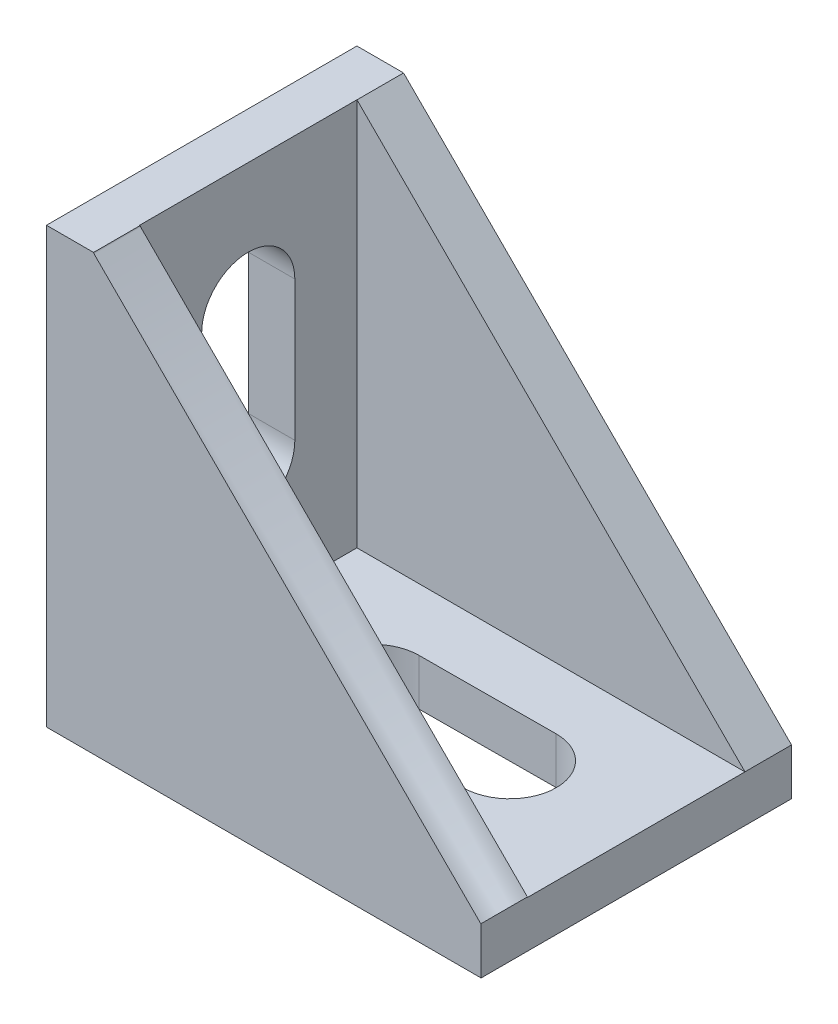
ISO-10303-21;
HEADER;
FILE_DESCRIPTION(('STEP AP214'),'2;1');
FILE_NAME('part.step','',(''),(''),'','','');
FILE_SCHEMA(('AUTOMOTIVE_DESIGN { 1 0 10303 214 1 1 1 1 }'));
ENDSEC;
DATA;
#1=APPLICATION_CONTEXT('core data for automotive mechanical design processes');
#2=APPLICATION_PROTOCOL_DEFINITION('international standard','automotive_design',2000,#1);
#3=PRODUCT_CONTEXT('',#1,'mechanical');
#4=PRODUCT('Part','Part','',(#3));
#5=PRODUCT_RELATED_PRODUCT_CATEGORY('part','',(#4));
#6=PRODUCT_DEFINITION_FORMATION('','',#4);
#7=PRODUCT_DEFINITION_CONTEXT('part definition',#1,'design');
#8=PRODUCT_DEFINITION('design','',#6,#7);
#9=PRODUCT_DEFINITION_SHAPE('','',#8);
#10=(LENGTH_UNIT() NAMED_UNIT(*) SI_UNIT(.MILLI.,.METRE.));
#11=(NAMED_UNIT(*) PLANE_ANGLE_UNIT() SI_UNIT($,.RADIAN.));
#12=(NAMED_UNIT(*) SI_UNIT($,.STERADIAN.) SOLID_ANGLE_UNIT());
#13=UNCERTAINTY_MEASURE_WITH_UNIT(LENGTH_MEASURE(1.E-05),#10,'distance_accuracy_value','');
#14=(GEOMETRIC_REPRESENTATION_CONTEXT(3) GLOBAL_UNCERTAINTY_ASSIGNED_CONTEXT((#13)) GLOBAL_UNIT_ASSIGNED_CONTEXT((#10,
#11,#12)) REPRESENTATION_CONTEXT('',''));
#15=CARTESIAN_POINT('',(0.,0.,0.));
#16=DIRECTION('',(0.,0.,1.));
#17=DIRECTION('',(1.,0.,0.));
#18=AXIS2_PLACEMENT_3D('',#15,#16,#17);
#19=CARTESIAN_POINT('',(0.,3.,0.));
#20=DIRECTION('',(0.,1.,0.));
#21=DIRECTION('',(0.,0.,1.));
#22=AXIS2_PLACEMENT_3D('',#19,#20,#21);
#23=PLANE('',#22);
#24=CARTESIAN_POINT('',(6.62955116916919,3.,-2.27958773683667));
#25=DIRECTION('',(0.,1.,0.));
#26=DIRECTION('',(0.,0.,1.));
#27=AXIS2_PLACEMENT_3D('',#24,#25,#26);
#28=CIRCLE('',#27,3.);
#29=CARTESIAN_POINT('',(6.64380261373427,3.,0.720378412360314));
#30=VERTEX_POINT('',#29);
#31=CARTESIAN_POINT('',(6.6152997246041,3.,-5.27955388603366));
#32=VERTEX_POINT('',#31);
#33=EDGE_CURVE('E48',#30,#32,#28,.T.);
#34=ORIENTED_EDGE('',*,*,#33,.F.);
#35=DIRECTION('',(0.999988716398996,0.,-0.00475048152169508));
#36=VECTOR('',#35,1.);
#37=CARTESIAN_POINT('',(6.64380261373427,3.,0.720378412360314));
#38=LINE('',#37,#36);
#39=CARTESIAN_POINT('',(-2.16057373026007,3.,0.762203911434752));
#40=VERTEX_POINT('',#39);
#41=EDGE_CURVE('E176',#40,#30,#38,.T.);
#42=ORIENTED_EDGE('',*,*,#41,.F.);
#43=CARTESIAN_POINT('',(-2.17482517482515,3.,-2.23776223776224));
#44=DIRECTION('',(0.,1.,0.));
#45=DIRECTION('',(0.,0.,1.));
#46=AXIS2_PLACEMENT_3D('',#43,#44,#45);
#47=CIRCLE('',#46,3.);
#48=CARTESIAN_POINT('',(-2.18907661939024,3.,-5.23772838695923));
#49=VERTEX_POINT('',#48);
#50=EDGE_CURVE('E161',#49,#40,#47,.T.);
#51=ORIENTED_EDGE('',*,*,#50,.F.);
#52=DIRECTION('',(-0.999988716398996,0.,0.00475048152169508));
#53=VECTOR('',#52,1.);
#54=CARTESIAN_POINT('',(6.6152997246041,3.,-5.27955388603366));
#55=LINE('',#54,#53);
#56=EDGE_CURVE('E170',#32,#49,#55,.T.);
#57=ORIENTED_EDGE('',*,*,#56,.F.);
#58=EDGE_LOOP('',(#34,#42,#51,#57));
#59=FACE_BOUND('',#58,.T.);
#60=DIRECTION('',(0.,0.,-1.));
#61=VECTOR('',#60,1.);
#62=CARTESIAN_POINT('',(14.8251748251748,3.,-12.2377622377622));
#63=LINE('',#62,#61);
#64=CARTESIAN_POINT('',(14.8251748251748,3.,4.76223776223776));
#65=VERTEX_POINT('',#64);
#66=CARTESIAN_POINT('',(14.8251748251748,3.,-9.23776223776224));
#67=VERTEX_POINT('',#66);
#68=EDGE_CURVE('E288',#65,#67,#63,.T.);
#69=ORIENTED_EDGE('',*,*,#68,.T.);
#70=DIRECTION('',(1.,0.,0.));
#71=VECTOR('',#70,1.);
#72=CARTESIAN_POINT('',(14.8251748251748,3.,-9.23776223776224));
#73=LINE('',#72,#71);
#74=CARTESIAN_POINT('',(-10.1748251748252,3.,-9.23776223776224));
#75=VERTEX_POINT('',#74);
#76=EDGE_CURVE('E254',#75,#67,#73,.T.);
#77=ORIENTED_EDGE('',*,*,#76,.F.);
#78=DIRECTION('',(0.,0.,-1.));
#79=VECTOR('',#78,1.);
#80=CARTESIAN_POINT('',(-10.1748251748252,3.,-12.2377622377622));
#81=LINE('',#80,#79);
#82=CARTESIAN_POINT('',(-10.1748251748252,3.,4.76223776223776));
#83=VERTEX_POINT('',#82);
#84=EDGE_CURVE('E273',#83,#75,#81,.T.);
#85=ORIENTED_EDGE('',*,*,#84,.F.);
#86=DIRECTION('',(-1.,0.,0.));
#87=VECTOR('',#86,1.);
#88=CARTESIAN_POINT('',(14.8251748251748,3.,4.76223776223776));
#89=LINE('',#88,#87);
#90=EDGE_CURVE('E264',#65,#83,#89,.T.);
#91=ORIENTED_EDGE('',*,*,#90,.F.);
#92=EDGE_LOOP('',(#69,#77,#85,#91));
#93=FACE_BOUND('',#92,.T.);
#94=ADVANCED_FACE('F33',(#59,#93),#23,.T.);
#95=CARTESIAN_POINT('',(-10.1748251748252,28.,-12.2377622377622));
#96=DIRECTION('',(-1.,0.,0.));
#97=DIRECTION('',(0.,0.,1.));
#98=AXIS2_PLACEMENT_3D('',#95,#96,#97);
#99=PLANE('',#98);
#100=DIRECTION('',(0.,1.,0.));
#101=VECTOR('',#100,1.);
#102=CARTESIAN_POINT('',(-10.1748251748252,11.,-5.23776223776224));
#103=LINE('',#102,#101);
#104=CARTESIAN_POINT('',(-10.1748251748252,11.,-5.23776223776224));
#105=VERTEX_POINT('',#104);
#106=CARTESIAN_POINT('',(-10.1748251748252,20.,-5.23776223776223));
#107=VERTEX_POINT('',#106);
#108=EDGE_CURVE('E187',#105,#107,#103,.T.);
#109=ORIENTED_EDGE('',*,*,#108,.F.);
#110=CARTESIAN_POINT('',(-10.1748251748252,11.,-2.23776223776224));
#111=DIRECTION('',(1.,0.,0.));
#112=DIRECTION('',(0.,0.,-1.));
#113=AXIS2_PLACEMENT_3D('',#110,#111,#112);
#114=CIRCLE('',#113,3.);
#115=CARTESIAN_POINT('',(-10.1748251748252,11.,0.762237762237761));
#116=VERTEX_POINT('',#115);
#117=EDGE_CURVE('E183',#116,#105,#114,.T.);
#118=ORIENTED_EDGE('',*,*,#117,.F.);
#119=DIRECTION('',(0.,-1.,0.));
#120=VECTOR('',#119,1.);
#121=CARTESIAN_POINT('',(-10.1748251748252,11.,0.762237762237761));
#122=LINE('',#121,#120);
#123=CARTESIAN_POINT('',(-10.1748251748252,20.,0.762237762237761));
#124=VERTEX_POINT('',#123);
#125=EDGE_CURVE('E193',#124,#116,#122,.T.);
#126=ORIENTED_EDGE('',*,*,#125,.F.);
#127=CARTESIAN_POINT('',(-10.1748251748252,20.,-2.23776223776224));
#128=DIRECTION('',(1.,0.,0.));
#129=DIRECTION('',(0.,0.,-1.));
#130=AXIS2_PLACEMENT_3D('',#127,#128,#129);
#131=CIRCLE('',#130,3.);
#132=EDGE_CURVE('E190',#107,#124,#131,.T.);
#133=ORIENTED_EDGE('',*,*,#132,.F.);
#134=EDGE_LOOP('',(#109,#118,#126,#133));
#135=FACE_BOUND('',#134,.T.);
#136=DIRECTION('',(0.,-1.,0.));
#137=VECTOR('',#136,1.);
#138=CARTESIAN_POINT('',(-10.1748251748252,28.,-9.23776223776224));
#139=LINE('',#138,#137);
#140=CARTESIAN_POINT('',(-10.1748251748252,28.,-9.23776223776224));
#141=VERTEX_POINT('',#140);
#142=EDGE_CURVE('E262',#141,#75,#139,.T.);
#143=ORIENTED_EDGE('',*,*,#142,.F.);
#144=DIRECTION('',(0.,0.,-1.));
#145=VECTOR('',#144,1.);
#146=CARTESIAN_POINT('',(-10.1748251748252,28.,-12.2377622377622));
#147=LINE('',#146,#145);
#148=CARTESIAN_POINT('',(-10.1748251748252,28.,4.76223776223777));
#149=VERTEX_POINT('',#148);
#150=EDGE_CURVE('E280',#149,#141,#147,.T.);
#151=ORIENTED_EDGE('',*,*,#150,.F.);
#152=DIRECTION('',(0.,-1.,0.));
#153=VECTOR('',#152,1.);
#154=CARTESIAN_POINT('',(-10.1748251748252,28.,4.76223776223776));
#155=LINE('',#154,#153);
#156=EDGE_CURVE('E267',#149,#83,#155,.T.);
#157=ORIENTED_EDGE('',*,*,#156,.T.);
#158=ORIENTED_EDGE('',*,*,#84,.T.);
#159=EDGE_LOOP('',(#143,#151,#157,#158));
#160=FACE_BOUND('',#159,.T.);
#161=ADVANCED_FACE('F354',(#135,#160),#99,.F.);
#162=CARTESIAN_POINT('',(-13.1748251748252,3.,-12.2377622377622));
#163=DIRECTION('',(1.,0.,0.));
#164=DIRECTION('',(0.,0.,-1.));
#165=AXIS2_PLACEMENT_3D('',#162,#163,#164);
#166=PLANE('',#165);
#167=DIRECTION('',(0.,-1.,0.));
#168=VECTOR('',#167,1.);
#169=CARTESIAN_POINT('',(-13.1748251748252,3.,0.762237762237761));
#170=LINE('',#169,#168);
#171=CARTESIAN_POINT('',(-13.1748251748252,20.,0.762237762237762));
#172=VERTEX_POINT('',#171);
#173=CARTESIAN_POINT('',(-13.1748251748252,11.,0.762237762237762));
#174=VERTEX_POINT('',#173);
#175=EDGE_CURVE('E325',#172,#174,#170,.T.);
#176=ORIENTED_EDGE('',*,*,#175,.T.);
#177=CARTESIAN_POINT('',(-13.1748251748252,11.,-2.23776223776224));
#178=DIRECTION('',(1.,0.,0.));
#179=DIRECTION('',(0.,0.,-1.));
#180=AXIS2_PLACEMENT_3D('',#177,#178,#179);
#181=CIRCLE('',#180,3.);
#182=CARTESIAN_POINT('',(-13.1748251748252,11.,-5.23776223776224));
#183=VERTEX_POINT('',#182);
#184=EDGE_CURVE('E328',#174,#183,#181,.T.);
#185=ORIENTED_EDGE('',*,*,#184,.T.);
#186=DIRECTION('',(0.,1.,0.));
#187=VECTOR('',#186,1.);
#188=CARTESIAN_POINT('',(-13.1748251748252,3.,-5.23776223776224));
#189=LINE('',#188,#187);
#190=CARTESIAN_POINT('',(-13.1748251748252,20.,-5.23776223776224));
#191=VERTEX_POINT('',#190);
#192=EDGE_CURVE('E316',#183,#191,#189,.T.);
#193=ORIENTED_EDGE('',*,*,#192,.T.);
#194=CARTESIAN_POINT('',(-13.1748251748252,20.,-2.23776223776224));
#195=DIRECTION('',(1.,0.,0.));
#196=DIRECTION('',(0.,0.,-1.));
#197=AXIS2_PLACEMENT_3D('',#194,#195,#196);
#198=CIRCLE('',#197,3.);
#199=EDGE_CURVE('E322',#191,#172,#198,.T.);
#200=ORIENTED_EDGE('',*,*,#199,.T.);
#201=EDGE_LOOP('',(#176,#185,#193,#200));
#202=FACE_BOUND('',#201,.T.);
#203=DIRECTION('',(0.,0.,1.));
#204=VECTOR('',#203,1.);
#205=CARTESIAN_POINT('',(-13.1748251748252,0.,-12.2377622377622));
#206=LINE('',#205,#204);
#207=CARTESIAN_POINT('',(-13.1748251748252,0.,-12.2377622377622));
#208=VERTEX_POINT('',#207);
#209=CARTESIAN_POINT('',(-13.1748251748252,0.,7.76223776223776));
#210=VERTEX_POINT('',#209);
#211=EDGE_CURVE('E285',#208,#210,#206,.T.);
#212=ORIENTED_EDGE('',*,*,#211,.T.);
#213=DIRECTION('',(0.,-1.,0.));
#214=VECTOR('',#213,1.);
#215=CARTESIAN_POINT('',(-13.1748251748252,3.,7.76223776223776));
#216=LINE('',#215,#214);
#217=CARTESIAN_POINT('',(-13.1748251748252,28.,7.76223776223776));
#218=VERTEX_POINT('',#217);
#219=EDGE_CURVE('E308',#218,#210,#216,.T.);
#220=ORIENTED_EDGE('',*,*,#219,.F.);
#221=DIRECTION('',(0.,0.,1.));
#222=VECTOR('',#221,1.);
#223=CARTESIAN_POINT('',(-13.1748251748252,28.,-12.2377622377622));
#224=LINE('',#223,#222);
#225=CARTESIAN_POINT('',(-13.1748251748252,28.,-12.2377622377622));
#226=VERTEX_POINT('',#225);
#227=EDGE_CURVE('E274',#226,#218,#224,.T.);
#228=ORIENTED_EDGE('',*,*,#227,.F.);
#229=DIRECTION('',(0.,-1.,0.));
#230=VECTOR('',#229,1.);
#231=CARTESIAN_POINT('',(-13.1748251748252,3.,-12.2377622377622));
#232=LINE('',#231,#230);
#233=EDGE_CURVE('E291',#226,#208,#232,.T.);
#234=ORIENTED_EDGE('',*,*,#233,.T.);
#235=EDGE_LOOP('',(#212,#220,#228,#234));
#236=FACE_BOUND('',#235,.T.);
#237=ADVANCED_FACE('F35',(#202,#236),#166,.F.);
#238=CARTESIAN_POINT('',(-13.1748251748252,3.,7.76223776223776));
#239=DIRECTION('',(0.,0.,-1.));
#240=DIRECTION('',(-1.,0.,0.));
#241=AXIS2_PLACEMENT_3D('',#238,#239,#240);
#242=PLANE('',#241);
#243=DIRECTION('',(0.,-1.,0.));
#244=VECTOR('',#243,1.);
#245=CARTESIAN_POINT('',(14.8251748251748,3.,7.76223776223776));
#246=LINE('',#245,#244);
#247=CARTESIAN_POINT('',(14.8251748251748,3.03348839103916,7.76223776223776));
#248=VERTEX_POINT('',#247);
#249=CARTESIAN_POINT('',(14.8251748251748,0.,7.76223776223776));
#250=VERTEX_POINT('',#249);
#251=EDGE_CURVE('E306',#248,#250,#246,.T.);
#252=ORIENTED_EDGE('',*,*,#251,.F.);
#253=CARTESIAN_POINT('',(35.0672525893617,33.9612128859628,7.76223776223775));
#254=CARTESIAN_POINT('',(35.0774542008554,33.9572279060878,7.76223776223775));
#255=CARTESIAN_POINT('',(35.0978574238427,33.9492579463377,7.76223776223775));
#256=CARTESIAN_POINT('',(35.1163083375369,33.8966490282362,7.76223776223775));
#257=CARTESIAN_POINT('',(35.105352773547,33.877680966017,7.76223776223775));
#258=CARTESIAN_POINT('',(35.0998749915521,33.8681969349074,7.76223776223775));
#259=CARTESIAN_POINT('',(30.3884412028001,25.7109930402229,7.76223776223775));
#260=CARTESIAN_POINT('',(25.677007414048,17.5537891455384,7.76223776223775));
#261=CARTESIAN_POINT('',(20.965573625296,9.39658525085391,7.76223776223775));
#262=CARTESIAN_POINT('',(20.8883973320785,9.26296504353752,7.76223776223775));
#263=CARTESIAN_POINT('',(20.7340447456437,8.99572462890472,7.76223776223775));
#264=CARTESIAN_POINT('',(20.4473893540673,8.6222145288925,7.76223776223775));
#265=CARTESIAN_POINT('',(20.2291668069369,8.40399198176201,7.76223776223775));
#266=CARTESIAN_POINT('',(20.1200555333716,8.29488070819676,7.76223776223775));
#267=CARTESIAN_POINT('',(18.3754565465604,6.55028172138555,7.76223776223775));
#268=CARTESIAN_POINT('',(16.6308575597492,4.80568273457433,7.76223776223775));
#269=CARTESIAN_POINT('',(14.886258572938,3.06108374776312,7.76223776223776));
#270=CARTESIAN_POINT('',(14.8766601879905,3.05148536281565,7.76223776223776));
#271=CARTESIAN_POINT('',(14.8574634180956,3.03228859292072,7.76223776223776));
#272=CARTESIAN_POINT('',(14.7928862322541,3.03228859292072,7.76223776223776));
#273=CARTESIAN_POINT('',(14.7736894623592,3.05148536281565,7.76223776223776));
#274=CARTESIAN_POINT('',(14.7640910774117,3.06108374776311,7.76223776223776));
#275=CARTESIAN_POINT('',(6.47713398757617,11.3480408375987,7.76223776223776));
#276=CARTESIAN_POINT('',(-1.80982310225939,19.6349979274342,7.76223776223776));
#277=CARTESIAN_POINT('',(-10.096780192095,27.9219550172698,7.76223776223776));
#278=CARTESIAN_POINT('',(-10.1104855499516,27.9356603751264,7.76223776223776));
#279=CARTESIAN_POINT('',(-10.1378962656648,27.9630710908397,7.76223776223776));
#280=CARTESIAN_POINT('',(-10.1482524753685,28.0449597632014,7.76223776223776));
#281=CARTESIAN_POINT('',(-10.1285287216183,28.0783314309726,7.76223776223776));
#282=CARTESIAN_POINT('',(-10.1186668447432,28.0950172648581,7.76223776223776));
#283=CARTESIAN_POINT('',(-8.17143615716044,31.3896404082466,7.76223776223776));
#284=CARTESIAN_POINT('',(-6.22420546957766,34.684263551635,7.76223776223776));
#285=CARTESIAN_POINT('',(-4.27697478199488,37.9788866950234,7.76223776223776));
#286=CARTESIAN_POINT('',(-4.25905817007432,38.0092007634392,7.76223776223776));
#287=CARTESIAN_POINT('',(-4.22322494623318,38.0698289002707,7.76223776223776));
#288=CARTESIAN_POINT('',(-4.11638728690729,38.1394755414262,7.76223776223776));
#289=CARTESIAN_POINT('',(-4.04645466319913,38.1477953399693,7.76223776223776));
#290=CARTESIAN_POINT('',(-4.01148835134505,38.1519552392409,7.76223776223776));
#291=CARTESIAN_POINT('',(3.09893559030034,38.9978736620586,7.76223776223776));
#292=CARTESIAN_POINT('',(10.2093595319457,39.8437920848762,7.76223776223776));
#293=CARTESIAN_POINT('',(17.3197834735911,40.6897105076939,7.76223776223775));
#294=CARTESIAN_POINT('',(17.3995441874561,40.6991995420791,7.76223776223775));
#295=CARTESIAN_POINT('',(17.559065615186,40.7181776108494,7.76223776223775));
#296=CARTESIAN_POINT('',(17.8141559939517,40.700662114853,7.76223776223775));
#297=CARTESIAN_POINT('',(17.9637913490545,40.6422111653098,7.76223776223775));
#298=CARTESIAN_POINT('',(18.0386090266059,40.6129856905382,7.76223776223775));
#299=CARTESIAN_POINT('',(23.7148235475245,38.3957280890131,7.76223776223775));
#300=CARTESIAN_POINT('',(29.3910380684431,36.1784704874879,7.76223776223775));
#301=CARTESIAN_POINT('',(35.0672525893617,33.9612128859628,7.76223776223775));
#302=B_SPLINE_CURVE_WITH_KNOTS('',3,(#253,#254,#255,#256,#257,#258,#259,#260,#261,#262,#263,
#264,#265,#266,#267,#268,#269,#270,#271,#272,#273,#274,#275,#276,#277,#278,#279,#280,#281,#282,
#283,#284,#285,#286,#287,#288,#289,#290,#291,#292,#293,#294,#295,#296,#297,#298,#299,#300,#301),
.UNSPECIFIED.,.T.,.F.,(4,1,1,3,3,1,1,3,3,1,1,3,3,1,1,3,3,1,1,3,3,1,1,3,4),(0.,
0.000263089380719506,0.000526178761439122,0.000789268142158628,0.227072132069683,
0.230778789838756,0.234485447607829,0.238192105376902,0.297458496255509,0.297784566394492,
0.298110636533475,0.298436706672459,0.579955864824744,0.580421454396905,0.580887043969066,
0.581352633541227,0.673283440852444,0.674129302931674,0.674975165010904,0.675821027090134,
0.847827671788225,0.849757145035282,0.851686618282339,0.853616091529395,1.),.UNSPECIFIED.);
#303=CARTESIAN_POINT('',(-10.1410099627485,28.,7.76223776223776));
#304=VERTEX_POINT('',#303);
#305=EDGE_CURVE('E383',#248,#304,#302,.T.);
#306=ORIENTED_EDGE('',*,*,#305,.T.);
#307=DIRECTION('',(1.,0.,0.));
#308=VECTOR('',#307,1.);
#309=CARTESIAN_POINT('',(-13.1748251748252,28.,7.76223776223776));
#310=LINE('',#309,#308);
#311=EDGE_CURVE('E277',#218,#304,#310,.T.);
#312=ORIENTED_EDGE('',*,*,#311,.F.);
#313=ORIENTED_EDGE('',*,*,#219,.T.);
#314=DIRECTION('',(1.,0.,0.));
#315=VECTOR('',#314,1.);
#316=CARTESIAN_POINT('',(-13.1748251748252,0.,7.76223776223776));
#317=LINE('',#316,#315);
#318=EDGE_CURVE('E295',#210,#250,#317,.T.);
#319=ORIENTED_EDGE('',*,*,#318,.T.);
#320=EDGE_LOOP('',(#252,#306,#312,#313,#319));
#321=FACE_BOUND('',#320,.T.);
#322=ADVANCED_FACE('F372',(#321),#242,.F.);
#323=CARTESIAN_POINT('',(14.8251748251748,3.,-12.2377622377622));
#324=DIRECTION('',(-1.,0.,0.));
#325=DIRECTION('',(0.,0.,1.));
#326=AXIS2_PLACEMENT_3D('',#323,#324,#325);
#327=PLANE('',#326);
#328=DIRECTION('',(0.,-1.,0.));
#329=VECTOR('',#328,1.);
#330=CARTESIAN_POINT('',(14.8251748251748,28.,4.76223776223776));
#331=LINE('',#330,#329);
#332=CARTESIAN_POINT('',(14.8251748251748,3.03348839103916,4.76223776223776));
#333=VERTEX_POINT('',#332);
#334=EDGE_CURVE('E271',#333,#65,#331,.T.);
#335=ORIENTED_EDGE('',*,*,#334,.F.);
#336=DIRECTION('',(0.,0.,-1.));
#337=VECTOR('',#336,1.);
#338=CARTESIAN_POINT('',(14.8251748251749,3.03348839103916,29.7622377622378));
#339=LINE('',#338,#337);
#340=EDGE_CURVE('E236',#333,#248,#339,.F.);
#341=ORIENTED_EDGE('',*,*,#340,.T.);
#342=ORIENTED_EDGE('',*,*,#251,.T.);
#343=DIRECTION('',(0.,0.,-1.));
#344=VECTOR('',#343,1.);
#345=CARTESIAN_POINT('',(14.8251748251748,0.,-12.2377622377622));
#346=LINE('',#345,#344);
#347=CARTESIAN_POINT('',(14.8251748251748,0.,-12.2377622377622));
#348=VERTEX_POINT('',#347);
#349=EDGE_CURVE('E298',#250,#348,#346,.T.);
#350=ORIENTED_EDGE('',*,*,#349,.T.);
#351=DIRECTION('',(0.,-1.,0.));
#352=VECTOR('',#351,1.);
#353=CARTESIAN_POINT('',(14.8251748251748,3.,-12.2377622377622));
#354=LINE('',#353,#352);
#355=CARTESIAN_POINT('',(14.8251748429918,3.00437816103314,-12.2377622377622));
#356=VERTEX_POINT('',#355);
#357=EDGE_CURVE('E304',#356,#348,#354,.T.);
#358=ORIENTED_EDGE('',*,*,#357,.F.);
#359=DIRECTION('',(0.,0.,1.));
#360=VECTOR('',#359,1.);
#361=CARTESIAN_POINT('',(14.8251748251748,3.00437816223935,-34.2377622377622));
#362=LINE('',#361,#360);
#363=CARTESIAN_POINT('',(14.8251748429923,3.00437816103311,-9.23776223776224));
#364=VERTEX_POINT('',#363);
#365=EDGE_CURVE('E248',#356,#364,#362,.T.);
#366=ORIENTED_EDGE('',*,*,#365,.T.);
#367=DIRECTION('',(0.,-1.,0.));
#368=VECTOR('',#367,1.);
#369=CARTESIAN_POINT('',(14.8251748251748,28.,-9.23776223776224));
#370=LINE('',#369,#368);
#371=EDGE_CURVE('E258',#364,#67,#370,.T.);
#372=ORIENTED_EDGE('',*,*,#371,.T.);
#373=ORIENTED_EDGE('',*,*,#68,.F.);
#374=EDGE_LOOP('',(#335,#341,#342,#350,#358,#366,#372,#373));
#375=FACE_BOUND('',#374,.T.);
#376=ADVANCED_FACE('F369',(#375),#327,.F.);
#377=CARTESIAN_POINT('',(-13.1748251748252,3.,-12.2377622377622));
#378=DIRECTION('',(0.,0.,1.));
#379=DIRECTION('',(1.,0.,0.));
#380=AXIS2_PLACEMENT_3D('',#377,#378,#379);
#381=PLANE('',#380);
#382=DIRECTION('',(-1.,0.,0.));
#383=VECTOR('',#382,1.);
#384=CARTESIAN_POINT('',(-13.1748251748252,28.,-12.2377622377622));
#385=LINE('',#384,#383);
#386=CARTESIAN_POINT('',(-10.1703433962215,28.,-12.2377622377622));
#387=VERTEX_POINT('',#386);
#388=EDGE_CURVE('E283',#387,#226,#385,.T.);
#389=ORIENTED_EDGE('',*,*,#388,.F.);
#390=CARTESIAN_POINT('',(14.8163682419722,3.00880658320267,-12.2377622377622));
#391=CARTESIAN_POINT('',(14.8178236194164,3.00735120575846,-12.2377622377622));
#392=CARTESIAN_POINT('',(14.8207343743048,3.00444045087003,-12.2377622377622));
#393=CARTESIAN_POINT('',(14.8300613135491,3.00394429198043,-12.2377622377622));
#394=CARTESIAN_POINT('',(14.8332644499735,3.00652981032066,-12.2377622377622));
#395=CARTESIAN_POINT('',(14.8348660181857,3.00782256949078,-12.2377622377622));
#396=CARTESIAN_POINT('',(16.974613251087,4.73499087615799,-12.2377622377622));
#397=CARTESIAN_POINT('',(19.1143604839884,6.46215918282521,-12.2377622377622));
#398=CARTESIAN_POINT('',(21.2541077168898,8.18932748949242,-12.2377622377622));
#399=CARTESIAN_POINT('',(21.257451293089,8.19202636847846,-12.2377622377622));
#400=CARTESIAN_POINT('',(21.2641384454876,8.19742412645053,-12.2377622377622));
#401=CARTESIAN_POINT('',(21.2704566650579,8.21191836640321,-12.2377622377622));
#402=CARTESIAN_POINT('',(21.269859563803,8.22049142119236,-12.2377622377622));
#403=CARTESIAN_POINT('',(21.2695610131756,8.22477794858694,-12.2377622377622));
#404=CARTESIAN_POINT('',(20.6124052886153,17.6600822389151,-12.2377622377622));
#405=CARTESIAN_POINT('',(19.9552495640549,27.0953865292433,-12.2377622377622));
#406=CARTESIAN_POINT('',(19.2980938394946,36.5306908195714,-12.2377622377622));
#407=CARTESIAN_POINT('',(19.298002293102,36.5320052235076,-12.2377622377622));
#408=CARTESIAN_POINT('',(19.2978192003167,36.5346340313799,-12.2377622377622));
#409=CARTESIAN_POINT('',(19.2918552313325,36.5381086332884,-12.2377622377622));
#410=CARTESIAN_POINT('',(19.2893241652576,36.5373752450408,-12.2377622377622));
#411=CARTESIAN_POINT('',(19.2880586322201,36.537008550917,-12.2377622377622));
#412=CARTESIAN_POINT('',(9.46937590118711,33.6919992509949,-12.2377622377622));
#413=CARTESIAN_POINT('',(-0.349306829845865,30.8469899510727,-12.2377622377622));
#414=CARTESIAN_POINT('',(-10.1679895608788,28.0019806511505,-12.2377622377622));
#415=CARTESIAN_POINT('',(-10.1688270932649,28.0017379722197,-12.2377622377622));
#416=CARTESIAN_POINT('',(-10.170502158037,28.0012526143581,-12.2377622377622));
#417=CARTESIAN_POINT('',(-10.1708765892962,27.9960514144711,-12.2377622377622));
#418=CARTESIAN_POINT('',(-10.169643419753,27.9948182449279,-12.2377622377622));
#419=CARTESIAN_POINT('',(-10.1690268349814,27.9942016601562,-12.2377622377622));
#420=CARTESIAN_POINT('',(-1.8405618093302,19.6657366345051,-12.2377622377622));
#421=CARTESIAN_POINT('',(6.48790321632099,11.3372716088539,-12.2377622377622));
#422=CARTESIAN_POINT('',(14.8163682419722,3.00880658320267,-12.2377622377622));
#423=B_SPLINE_CURVE_WITH_KNOTS('',3,(#390,#391,#392,#393,#394,#395,#396,#397,#398,#399,#400,
#401,#402,#403,#404,#405,#406,#407,#408,#409,#410,#411,#412,#413,#414,#415,#416,#417,#418,#419,
#420,#421,#422),.UNSPECIFIED.,.T.,.F.,(4,1,1,3,3,1,1,3,3,1,1,3,3,1,1,3,4),(0.,
6.01212043163102E-05,0.000120242408632509,0.00018036361294882,0.0805042484121947,
0.0806297627838543,0.0807552771555137,0.0808807915271732,0.357157175743177,0.357195662977473,
0.357234150211769,0.357272637446065,0.655877202922673,0.655902673854066,0.655928144785458,
0.655953615716851,1.),.UNSPECIFIED.);
#424=EDGE_CURVE('E243',#387,#356,#423,.T.);
#425=ORIENTED_EDGE('',*,*,#424,.T.);
#426=ORIENTED_EDGE('',*,*,#357,.T.);
#427=DIRECTION('',(-1.,0.,0.));
#428=VECTOR('',#427,1.);
#429=CARTESIAN_POINT('',(-13.1748251748252,0.,-12.2377622377622));
#430=LINE('',#429,#428);
#431=EDGE_CURVE('E292',#348,#208,#430,.T.);
#432=ORIENTED_EDGE('',*,*,#431,.T.);
#433=ORIENTED_EDGE('',*,*,#233,.F.);
#434=EDGE_LOOP('',(#389,#425,#426,#432,#433));
#435=FACE_BOUND('',#434,.T.);
#436=ADVANCED_FACE('F366',(#435),#381,.F.);
#437=CARTESIAN_POINT('',(0.,0.,0.));
#438=DIRECTION('',(0.,1.,0.));
#439=DIRECTION('',(0.,0.,1.));
#440=AXIS2_PLACEMENT_3D('',#437,#438,#439);
#441=PLANE('',#440);
#442=DIRECTION('',(0.999988716398996,0.,-0.00475048152169508));
#443=VECTOR('',#442,1.);
#444=CARTESIAN_POINT('',(0.00357203691223068,0.,0.75192306095253));
#445=LINE('',#444,#443);
#446=CARTESIAN_POINT('',(-2.16057373026007,0.,0.762203911434752));
#447=VERTEX_POINT('',#446);
#448=CARTESIAN_POINT('',(6.64380261373427,0.,0.720378412360314));
#449=VERTEX_POINT('',#448);
#450=EDGE_CURVE('E41',#447,#449,#445,.T.);
#451=ORIENTED_EDGE('',*,*,#450,.T.);
#452=CARTESIAN_POINT('',(6.62955116916919,0.,-2.27958773683667));
#453=DIRECTION('',(0.,1.,0.));
#454=DIRECTION('',(0.,0.,1.));
#455=AXIS2_PLACEMENT_3D('',#452,#453,#454);
#456=CIRCLE('',#455,3.);
#457=CARTESIAN_POINT('',(6.6152997246041,0.,-5.27955388603366));
#458=VERTEX_POINT('',#457);
#459=EDGE_CURVE('E11',#449,#458,#456,.T.);
#460=ORIENTED_EDGE('',*,*,#459,.T.);
#461=DIRECTION('',(-0.999988716398996,0.,0.00475048152169508));
#462=VECTOR('',#461,1.);
#463=CARTESIAN_POINT('',(-0.0249308522179398,0.,-5.24800923744145));
#464=LINE('',#463,#462);
#465=CARTESIAN_POINT('',(-2.18907661939024,0.,-5.23772838695923));
#466=VERTEX_POINT('',#465);
#467=EDGE_CURVE('E331',#458,#466,#464,.T.);
#468=ORIENTED_EDGE('',*,*,#467,.T.);
#469=CARTESIAN_POINT('',(-2.17482517482515,0.,-2.23776223776224));
#470=DIRECTION('',(0.,1.,0.));
#471=DIRECTION('',(0.,0.,1.));
#472=AXIS2_PLACEMENT_3D('',#469,#470,#471);
#473=CIRCLE('',#472,3.);
#474=EDGE_CURVE('E164',#466,#447,#473,.T.);
#475=ORIENTED_EDGE('',*,*,#474,.T.);
#476=EDGE_LOOP('',(#451,#460,#468,#475));
#477=FACE_BOUND('',#476,.T.);
#478=ORIENTED_EDGE('',*,*,#211,.F.);
#479=ORIENTED_EDGE('',*,*,#431,.F.);
#480=ORIENTED_EDGE('',*,*,#349,.F.);
#481=ORIENTED_EDGE('',*,*,#318,.F.);
#482=EDGE_LOOP('',(#478,#479,#480,#481));
#483=FACE_BOUND('',#482,.T.);
#484=ADVANCED_FACE('F335',(#477,#483),#441,.F.);
#485=CARTESIAN_POINT('',(0.,28.,0.));
#486=DIRECTION('',(0.,1.,0.));
#487=DIRECTION('',(0.,0.,1.));
#488=AXIS2_PLACEMENT_3D('',#485,#486,#487);
#489=PLANE('',#488);
#490=DIRECTION('',(0.,0.,-1.));
#491=VECTOR('',#490,1.);
#492=CARTESIAN_POINT('',(-10.1410099627485,28.,29.7622377622378));
#493=LINE('',#492,#491);
#494=CARTESIAN_POINT('',(-10.1410099621863,27.9999999963765,4.76223776223776));
#495=VERTEX_POINT('',#494);
#496=EDGE_CURVE('E391',#495,#304,#493,.F.);
#497=ORIENTED_EDGE('',*,*,#496,.F.);
#498=DIRECTION('',(-1.,0.,0.));
#499=VECTOR('',#498,1.);
#500=CARTESIAN_POINT('',(14.8251748251748,28.,4.76223776223776));
#501=LINE('',#500,#499);
#502=EDGE_CURVE('E265',#495,#149,#501,.T.);
#503=ORIENTED_EDGE('',*,*,#502,.T.);
#504=ORIENTED_EDGE('',*,*,#150,.T.);
#505=DIRECTION('',(1.,0.,0.));
#506=VECTOR('',#505,1.);
#507=CARTESIAN_POINT('',(14.8251748251748,28.,-9.23776223776224));
#508=LINE('',#507,#506);
#509=CARTESIAN_POINT('',(-10.170343393958,28.,-9.23776223776224));
#510=VERTEX_POINT('',#509);
#511=EDGE_CURVE('E255',#141,#510,#508,.T.);
#512=ORIENTED_EDGE('',*,*,#511,.T.);
#513=DIRECTION('',(0.,0.,1.));
#514=VECTOR('',#513,1.);
#515=CARTESIAN_POINT('',(-10.1703433962215,28.,-34.2377622377622));
#516=LINE('',#515,#514);
#517=EDGE_CURVE('E238',#387,#510,#516,.T.);
#518=ORIENTED_EDGE('',*,*,#517,.F.);
#519=ORIENTED_EDGE('',*,*,#388,.T.);
#520=ORIENTED_EDGE('',*,*,#227,.T.);
#521=ORIENTED_EDGE('',*,*,#311,.T.);
#522=EDGE_LOOP('',(#497,#503,#504,#512,#518,#519,#520,#521));
#523=FACE_BOUND('',#522,.T.);
#524=ADVANCED_FACE('F365',(#523),#489,.T.);
#525=CARTESIAN_POINT('',(14.8251748251748,28.,4.76223776223776));
#526=DIRECTION('',(0.,0.,1.));
#527=DIRECTION('',(1.,0.,0.));
#528=AXIS2_PLACEMENT_3D('',#525,#526,#527);
#529=PLANE('',#528);
#530=ORIENTED_EDGE('',*,*,#502,.F.);
#531=CARTESIAN_POINT('',(35.0672525893617,33.9612128859628,4.76223776223776));
#532=CARTESIAN_POINT('',(35.0774542008553,33.9572279060878,4.76223776223776));
#533=CARTESIAN_POINT('',(35.0978574238427,33.9492579463377,4.76223776223776));
#534=CARTESIAN_POINT('',(35.1163083375369,33.8966490282362,4.76223776223776));
#535=CARTESIAN_POINT('',(35.105352773547,33.877680966017,4.76223776223776));
#536=CARTESIAN_POINT('',(35.0998749915521,33.8681969349074,4.76223776223776));
#537=CARTESIAN_POINT('',(30.3884412028001,25.7109930402229,4.76223776223776));
#538=CARTESIAN_POINT('',(25.677007414048,17.5537891455384,4.76223776223776));
#539=CARTESIAN_POINT('',(20.965573625296,9.39658525085391,4.76223776223776));
#540=CARTESIAN_POINT('',(20.8883973320785,9.26296504353752,4.76223776223776));
#541=CARTESIAN_POINT('',(20.7340447456437,8.99572462890472,4.76223776223776));
#542=CARTESIAN_POINT('',(20.4473893540673,8.6222145288925,4.76223776223776));
#543=CARTESIAN_POINT('',(20.2291668069369,8.40399198176201,4.76223776223776));
#544=CARTESIAN_POINT('',(20.1200555333716,8.29488070819676,4.76223776223776));
#545=CARTESIAN_POINT('',(18.3754565465604,6.55028172138555,4.76223776223776));
#546=CARTESIAN_POINT('',(16.6308575597492,4.80568273457433,4.76223776223776));
#547=CARTESIAN_POINT('',(14.886258572938,3.06108374776312,4.76223776223776));
#548=CARTESIAN_POINT('',(14.8766601879905,3.05148536281565,4.76223776223776));
#549=CARTESIAN_POINT('',(14.8574634180956,3.03228859292072,4.76223776223776));
#550=CARTESIAN_POINT('',(14.7928862322541,3.03228859292072,4.76223776223776));
#551=CARTESIAN_POINT('',(14.7736894623592,3.05148536281565,4.76223776223776));
#552=CARTESIAN_POINT('',(14.7640910774117,3.06108374776311,4.76223776223776));
#553=CARTESIAN_POINT('',(6.47713398757617,11.3480408375987,4.76223776223776));
#554=CARTESIAN_POINT('',(-1.80982310225939,19.6349979274342,4.76223776223776));
#555=CARTESIAN_POINT('',(-10.096780192095,27.9219550172698,4.76223776223776));
#556=CARTESIAN_POINT('',(-10.1104855499516,27.9356603751264,4.76223776223776));
#557=CARTESIAN_POINT('',(-10.1378962656648,27.9630710908397,4.76223776223776));
#558=CARTESIAN_POINT('',(-10.1482524753685,28.0449597632014,4.76223776223776));
#559=CARTESIAN_POINT('',(-10.1285287216183,28.0783314309726,4.76223776223776));
#560=CARTESIAN_POINT('',(-10.1186668447432,28.0950172648581,4.76223776223776));
#561=CARTESIAN_POINT('',(-8.17143615716044,31.3896404082466,4.76223776223776));
#562=CARTESIAN_POINT('',(-6.22420546957766,34.684263551635,4.76223776223776));
#563=CARTESIAN_POINT('',(-4.27697478199488,37.9788866950234,4.76223776223776));
#564=CARTESIAN_POINT('',(-4.25905817007432,38.0092007634392,4.76223776223776));
#565=CARTESIAN_POINT('',(-4.22322494623318,38.0698289002707,4.76223776223776));
#566=CARTESIAN_POINT('',(-4.11638728690729,38.1394755414262,4.76223776223776));
#567=CARTESIAN_POINT('',(-4.04645466319913,38.1477953399693,4.76223776223776));
#568=CARTESIAN_POINT('',(-4.01148835134505,38.1519552392409,4.76223776223776));
#569=CARTESIAN_POINT('',(3.09893559030034,38.9978736620586,4.76223776223776));
#570=CARTESIAN_POINT('',(10.2093595319457,39.8437920848762,4.76223776223776));
#571=CARTESIAN_POINT('',(17.3197834735911,40.6897105076939,4.76223776223776));
#572=CARTESIAN_POINT('',(17.3995441874561,40.6991995420791,4.76223776223776));
#573=CARTESIAN_POINT('',(17.559065615186,40.7181776108494,4.76223776223776));
#574=CARTESIAN_POINT('',(17.8141559939517,40.700662114853,4.76223776223776));
#575=CARTESIAN_POINT('',(17.9637913490545,40.6422111653098,4.76223776223776));
#576=CARTESIAN_POINT('',(18.0386090266059,40.6129856905382,4.76223776223776));
#577=CARTESIAN_POINT('',(23.7148235475245,38.3957280890131,4.76223776223776));
#578=CARTESIAN_POINT('',(29.3910380684431,36.1784704874879,4.76223776223776));
#579=CARTESIAN_POINT('',(35.0672525893617,33.9612128859628,4.76223776223776));
#580=B_SPLINE_CURVE_WITH_KNOTS('',3,(#531,#532,#533,#534,#535,#536,#537,#538,#539,#540,#541,
#542,#543,#544,#545,#546,#547,#548,#549,#550,#551,#552,#553,#554,#555,#556,#557,#558,#559,#560,
#561,#562,#563,#564,#565,#566,#567,#568,#569,#570,#571,#572,#573,#574,#575,#576,#577,#578,#579),
.UNSPECIFIED.,.T.,.F.,(4,1,1,3,3,1,1,3,3,1,1,3,3,1,1,3,3,1,1,3,3,1,1,3,4),(0.,
0.000263089380719506,0.000526178761439122,0.000789268142158628,0.227072132069683,
0.230778789838756,0.234485447607829,0.238192105376902,0.297458496255509,0.297784566394492,
0.298110636533475,0.298436706672459,0.579955864824744,0.580421454396905,0.580887043969066,
0.581352633541227,0.673283440852444,0.674129302931674,0.674975165010904,0.675821027090134,
0.847827671788225,0.849757145035282,0.851686618282339,0.853616091529395,1.),.UNSPECIFIED.);
#581=EDGE_CURVE('E199',#333,#495,#580,.T.);
#582=ORIENTED_EDGE('',*,*,#581,.F.);
#583=ORIENTED_EDGE('',*,*,#334,.T.);
#584=ORIENTED_EDGE('',*,*,#90,.T.);
#585=ORIENTED_EDGE('',*,*,#156,.F.);
#586=EDGE_LOOP('',(#530,#582,#583,#584,#585));
#587=FACE_BOUND('',#586,.T.);
#588=ADVANCED_FACE('F402',(#587),#529,.F.);
#589=CARTESIAN_POINT('',(14.8251748251748,28.,-9.23776223776224));
#590=DIRECTION('',(0.,0.,-1.));
#591=DIRECTION('',(-1.,0.,0.));
#592=AXIS2_PLACEMENT_3D('',#589,#590,#591);
#593=PLANE('',#592);
#594=ORIENTED_EDGE('',*,*,#371,.F.);
#595=CARTESIAN_POINT('',(14.8163682419722,3.00880658320267,-9.23776223776223));
#596=CARTESIAN_POINT('',(14.8178236194164,3.00735120575846,-9.23776223776223));
#597=CARTESIAN_POINT('',(14.8207343743048,3.00444045087003,-9.23776223776223));
#598=CARTESIAN_POINT('',(14.8300613135491,3.00394429198043,-9.23776223776223));
#599=CARTESIAN_POINT('',(14.8332644499735,3.00652981032066,-9.23776223776223));
#600=CARTESIAN_POINT('',(14.8348660181857,3.00782256949078,-9.23776223776223));
#601=CARTESIAN_POINT('',(16.974613251087,4.73499087615799,-9.23776223776223));
#602=CARTESIAN_POINT('',(19.1143604839884,6.46215918282521,-9.23776223776223));
#603=CARTESIAN_POINT('',(21.2541077168898,8.18932748949242,-9.23776223776223));
#604=CARTESIAN_POINT('',(21.257451293089,8.19202636847846,-9.23776223776223));
#605=CARTESIAN_POINT('',(21.2641384454876,8.19742412645053,-9.23776223776223));
#606=CARTESIAN_POINT('',(21.2704566650579,8.21191836640321,-9.23776223776223));
#607=CARTESIAN_POINT('',(21.269859563803,8.22049142119236,-9.23776223776223));
#608=CARTESIAN_POINT('',(21.2695610131756,8.22477794858694,-9.23776223776223));
#609=CARTESIAN_POINT('',(20.6124052886153,17.6600822389151,-9.23776223776223));
#610=CARTESIAN_POINT('',(19.9552495640549,27.0953865292433,-9.23776223776223));
#611=CARTESIAN_POINT('',(19.2980938394946,36.5306908195714,-9.23776223776223));
#612=CARTESIAN_POINT('',(19.298002293102,36.5320052235076,-9.23776223776223));
#613=CARTESIAN_POINT('',(19.2978192003167,36.5346340313799,-9.23776223776223));
#614=CARTESIAN_POINT('',(19.2918552313325,36.5381086332884,-9.23776223776223));
#615=CARTESIAN_POINT('',(19.2893241652576,36.5373752450408,-9.23776223776223));
#616=CARTESIAN_POINT('',(19.2880586322201,36.537008550917,-9.23776223776223));
#617=CARTESIAN_POINT('',(9.46937590118711,33.6919992509949,-9.23776223776223));
#618=CARTESIAN_POINT('',(-0.349306829845865,30.8469899510727,-9.23776223776223));
#619=CARTESIAN_POINT('',(-10.1679895608788,28.0019806511505,-9.23776223776223));
#620=CARTESIAN_POINT('',(-10.1688270932649,28.0017379722197,-9.23776223776223));
#621=CARTESIAN_POINT('',(-10.170502158037,28.0012526143581,-9.23776223776223));
#622=CARTESIAN_POINT('',(-10.1708765892962,27.9960514144711,-9.23776223776223));
#623=CARTESIAN_POINT('',(-10.169643419753,27.9948182449279,-9.23776223776223));
#624=CARTESIAN_POINT('',(-10.1690268349814,27.9942016601562,-9.23776223776223));
#625=CARTESIAN_POINT('',(-1.8405618093302,19.6657366345051,-9.23776223776223));
#626=CARTESIAN_POINT('',(6.48790321632099,11.3372716088539,-9.23776223776223));
#627=CARTESIAN_POINT('',(14.8163682419722,3.00880658320267,-9.23776223776223));
#628=B_SPLINE_CURVE_WITH_KNOTS('',3,(#595,#596,#597,#598,#599,#600,#601,#602,#603,#604,#605,
#606,#607,#608,#609,#610,#611,#612,#613,#614,#615,#616,#617,#618,#619,#620,#621,#622,#623,#624,
#625,#626,#627),.UNSPECIFIED.,.T.,.F.,(4,1,1,3,3,1,1,3,3,1,1,3,3,1,1,3,4),(0.,
6.01212043163102E-05,0.000120242408632509,0.00018036361294882,0.0805042484121947,
0.0806297627838543,0.0807552771555137,0.0808807915271732,0.357157175743177,0.357195662977473,
0.357234150211769,0.357272637446065,0.655877202922673,0.655902673854066,0.655928144785458,
0.655953615716851,1.),.UNSPECIFIED.);
#629=EDGE_CURVE('E311',#364,#510,#628,.F.);
#630=ORIENTED_EDGE('',*,*,#629,.T.);
#631=ORIENTED_EDGE('',*,*,#511,.F.);
#632=ORIENTED_EDGE('',*,*,#142,.T.);
#633=ORIENTED_EDGE('',*,*,#76,.T.);
#634=EDGE_LOOP('',(#594,#630,#631,#632,#633));
#635=FACE_BOUND('',#634,.T.);
#636=ADVANCED_FACE('F228',(#635),#593,.F.);
#637=CARTESIAN_POINT('',(14.8163682419722,3.00880658320267,-34.2377622377622));
#638=CARTESIAN_POINT('',(14.8178236194164,3.00735120575846,-34.2377622377622));
#639=CARTESIAN_POINT('',(14.8207343743048,3.00444045087003,-34.2377622377622));
#640=CARTESIAN_POINT('',(14.8300613135491,3.00394429198043,-34.2377622377622));
#641=CARTESIAN_POINT('',(14.8332644499735,3.00652981032066,-34.2377622377622));
#642=CARTESIAN_POINT('',(14.8348660181857,3.00782256949078,-34.2377622377622));
#643=CARTESIAN_POINT('',(16.974613251087,4.73499087615799,-34.2377622377622));
#644=CARTESIAN_POINT('',(19.1143604839884,6.46215918282521,-34.2377622377622));
#645=CARTESIAN_POINT('',(21.2541077168898,8.18932748949242,-34.2377622377622));
#646=CARTESIAN_POINT('',(21.257451293089,8.19202636847846,-34.2377622377622));
#647=CARTESIAN_POINT('',(21.2641384454876,8.19742412645053,-34.2377622377622));
#648=CARTESIAN_POINT('',(21.2704566650579,8.21191836640321,-34.2377622377622));
#649=CARTESIAN_POINT('',(21.269859563803,8.22049142119236,-34.2377622377622));
#650=CARTESIAN_POINT('',(21.2695610131756,8.22477794858694,-34.2377622377622));
#651=CARTESIAN_POINT('',(20.6124052886153,17.6600822389151,-34.2377622377622));
#652=CARTESIAN_POINT('',(19.9552495640549,27.0953865292433,-34.2377622377622));
#653=CARTESIAN_POINT('',(19.2980938394946,36.5306908195714,-34.2377622377622));
#654=CARTESIAN_POINT('',(19.298002293102,36.5320052235076,-34.2377622377622));
#655=CARTESIAN_POINT('',(19.2978192003167,36.5346340313799,-34.2377622377622));
#656=CARTESIAN_POINT('',(19.2918552313325,36.5381086332884,-34.2377622377622));
#657=CARTESIAN_POINT('',(19.2893241652576,36.5373752450408,-34.2377622377622));
#658=CARTESIAN_POINT('',(19.2880586322201,36.537008550917,-34.2377622377622));
#659=CARTESIAN_POINT('',(9.46937590118711,33.6919992509949,-34.2377622377622));
#660=CARTESIAN_POINT('',(-0.349306829845865,30.8469899510727,-34.2377622377622));
#661=CARTESIAN_POINT('',(-10.1679895608788,28.0019806511505,-34.2377622377622));
#662=CARTESIAN_POINT('',(-10.1688270932649,28.0017379722197,-34.2377622377622));
#663=CARTESIAN_POINT('',(-10.170502158037,28.0012526143581,-34.2377622377622));
#664=CARTESIAN_POINT('',(-10.1708765892962,27.9960514144711,-34.2377622377622));
#665=CARTESIAN_POINT('',(-10.169643419753,27.9948182449279,-34.2377622377622));
#666=CARTESIAN_POINT('',(-10.1690268349814,27.9942016601562,-34.2377622377622));
#667=CARTESIAN_POINT('',(-1.8405618093302,19.6657366345051,-34.2377622377622));
#668=CARTESIAN_POINT('',(6.48790321632099,11.3372716088539,-34.2377622377622));
#669=CARTESIAN_POINT('',(14.8163682419722,3.00880658320267,-34.2377622377622));
#670=B_SPLINE_CURVE_WITH_KNOTS('',3,(#637,#638,#639,#640,#641,#642,#643,#644,#645,#646,#647,
#648,#649,#650,#651,#652,#653,#654,#655,#656,#657,#658,#659,#660,#661,#662,#663,#664,#665,#666,
#667,#668,#669),.UNSPECIFIED.,.T.,.F.,(4,1,1,3,3,1,1,3,3,1,1,3,3,1,1,3,4),(0.,
6.01212043163102E-05,0.000120242408632509,0.00018036361294882,0.0805042484121947,
0.0806297627838543,0.0807552771555137,0.0808807915271732,0.357157175743177,0.357195662977473,
0.357234150211769,0.357272637446065,0.655877202922673,0.655902673854066,0.655928144785458,
0.655953615716851,1.),.UNSPECIFIED.);
#671=DIRECTION('',(0.,0.,1.));
#672=VECTOR('',#671,1.);
#673=SURFACE_OF_LINEAR_EXTRUSION('',#670,#672);
#674=ORIENTED_EDGE('',*,*,#424,.F.);
#675=ORIENTED_EDGE('',*,*,#517,.T.);
#676=ORIENTED_EDGE('',*,*,#629,.F.);
#677=ORIENTED_EDGE('',*,*,#365,.F.);
#678=EDGE_LOOP('',(#674,#675,#676,#677));
#679=FACE_BOUND('',#678,.T.);
#680=ADVANCED_FACE('F222',(#679),#673,.F.);
#681=CARTESIAN_POINT('',(35.0672525893617,33.9612128859628,29.7622377622378));
#682=CARTESIAN_POINT('',(35.0774542008554,33.9572279060878,29.7622377622378));
#683=CARTESIAN_POINT('',(35.0978574238427,33.9492579463377,29.7622377622378));
#684=CARTESIAN_POINT('',(35.1163083375369,33.8966490282362,29.7622377622378));
#685=CARTESIAN_POINT('',(35.105352773547,33.877680966017,29.7622377622378));
#686=CARTESIAN_POINT('',(35.0998749915521,33.8681969349074,29.7622377622378));
#687=CARTESIAN_POINT('',(30.3884412028001,25.7109930402229,29.7622377622378));
#688=CARTESIAN_POINT('',(25.677007414048,17.5537891455384,29.7622377622378));
#689=CARTESIAN_POINT('',(20.965573625296,9.39658525085391,29.7622377622378));
#690=CARTESIAN_POINT('',(20.8883973320785,9.26296504353752,29.7622377622378));
#691=CARTESIAN_POINT('',(20.7340447456437,8.99572462890472,29.7622377622378));
#692=CARTESIAN_POINT('',(20.4473893540674,8.6222145288925,29.7622377622378));
#693=CARTESIAN_POINT('',(20.2291668069369,8.40399198176201,29.7622377622378));
#694=CARTESIAN_POINT('',(20.1200555333716,8.29488070819676,29.7622377622378));
#695=CARTESIAN_POINT('',(18.3754565465604,6.55028172138555,29.7622377622378));
#696=CARTESIAN_POINT('',(16.6308575597492,4.80568273457433,29.7622377622378));
#697=CARTESIAN_POINT('',(14.886258572938,3.06108374776312,29.7622377622378));
#698=CARTESIAN_POINT('',(14.8766601879905,3.05148536281565,29.7622377622378));
#699=CARTESIAN_POINT('',(14.8574634180956,3.03228859292072,29.7622377622378));
#700=CARTESIAN_POINT('',(14.7928862322541,3.03228859292072,29.7622377622378));
#701=CARTESIAN_POINT('',(14.7736894623592,3.05148536281565,29.7622377622378));
#702=CARTESIAN_POINT('',(14.7640910774117,3.06108374776311,29.7622377622378));
#703=CARTESIAN_POINT('',(6.47713398757617,11.3480408375987,29.7622377622378));
#704=CARTESIAN_POINT('',(-1.80982310225939,19.6349979274342,29.7622377622378));
#705=CARTESIAN_POINT('',(-10.096780192095,27.9219550172698,29.7622377622378));
#706=CARTESIAN_POINT('',(-10.1104855499516,27.9356603751264,29.7622377622378));
#707=CARTESIAN_POINT('',(-10.1378962656648,27.9630710908397,29.7622377622378));
#708=CARTESIAN_POINT('',(-10.1482524753685,28.0449597632014,29.7622377622378));
#709=CARTESIAN_POINT('',(-10.1285287216183,28.0783314309726,29.7622377622378));
#710=CARTESIAN_POINT('',(-10.1186668447432,28.0950172648581,29.7622377622378));
#711=CARTESIAN_POINT('',(-8.17143615716044,31.3896404082466,29.7622377622378));
#712=CARTESIAN_POINT('',(-6.22420546957766,34.684263551635,29.7622377622378));
#713=CARTESIAN_POINT('',(-4.27697478199488,37.9788866950234,29.7622377622378));
#714=CARTESIAN_POINT('',(-4.25905817007431,38.0092007634392,29.7622377622378));
#715=CARTESIAN_POINT('',(-4.22322494623318,38.0698289002707,29.7622377622378));
#716=CARTESIAN_POINT('',(-4.11638728690729,38.1394755414262,29.7622377622378));
#717=CARTESIAN_POINT('',(-4.04645466319913,38.1477953399693,29.7622377622378));
#718=CARTESIAN_POINT('',(-4.01148835134505,38.1519552392409,29.7622377622378));
#719=CARTESIAN_POINT('',(3.09893559030034,38.9978736620586,29.7622377622378));
#720=CARTESIAN_POINT('',(10.2093595319457,39.8437920848762,29.7622377622378));
#721=CARTESIAN_POINT('',(17.3197834735911,40.6897105076939,29.7622377622378));
#722=CARTESIAN_POINT('',(17.3995441874561,40.6991995420791,29.7622377622378));
#723=CARTESIAN_POINT('',(17.559065615186,40.7181776108494,29.7622377622378));
#724=CARTESIAN_POINT('',(17.8141559939517,40.700662114853,29.7622377622378));
#725=CARTESIAN_POINT('',(17.9637913490545,40.6422111653098,29.7622377622378));
#726=CARTESIAN_POINT('',(18.0386090266059,40.6129856905382,29.7622377622378));
#727=CARTESIAN_POINT('',(23.7148235475245,38.3957280890131,29.7622377622378));
#728=CARTESIAN_POINT('',(29.3910380684431,36.1784704874879,29.7622377622378));
#729=CARTESIAN_POINT('',(35.0672525893617,33.9612128859628,29.7622377622378));
#730=B_SPLINE_CURVE_WITH_KNOTS('',3,(#681,#682,#683,#684,#685,#686,#687,#688,#689,#690,#691,
#692,#693,#694,#695,#696,#697,#698,#699,#700,#701,#702,#703,#704,#705,#706,#707,#708,#709,#710,
#711,#712,#713,#714,#715,#716,#717,#718,#719,#720,#721,#722,#723,#724,#725,#726,#727,#728,#729),
.UNSPECIFIED.,.T.,.F.,(4,1,1,3,3,1,1,3,3,1,1,3,3,1,1,3,3,1,1,3,3,1,1,3,4),(0.,
0.000263089380719506,0.000526178761439122,0.000789268142158628,0.227072132069683,
0.230778789838756,0.234485447607829,0.238192105376902,0.297458496255509,0.297784566394492,
0.298110636533475,0.298436706672459,0.579955864824744,0.580421454396905,0.580887043969066,
0.581352633541227,0.673283440852444,0.674129302931674,0.674975165010904,0.675821027090134,
0.847827671788225,0.849757145035282,0.851686618282339,0.853616091529395,1.),.UNSPECIFIED.);
#731=DIRECTION('',(0.,0.,-1.));
#732=VECTOR('',#731,1.);
#733=SURFACE_OF_LINEAR_EXTRUSION('',#730,#732);
#734=ORIENTED_EDGE('',*,*,#581,.T.);
#735=ORIENTED_EDGE('',*,*,#496,.T.);
#736=ORIENTED_EDGE('',*,*,#305,.F.);
#737=ORIENTED_EDGE('',*,*,#340,.F.);
#738=EDGE_LOOP('',(#734,#735,#736,#737));
#739=FACE_BOUND('',#738,.T.);
#740=ADVANCED_FACE('F217',(#739),#733,.F.);
#741=CARTESIAN_POINT('',(-35.1748251748252,11.,-2.23776223776223));
#742=DIRECTION('',(1.,0.,0.));
#743=DIRECTION('',(0.,0.,-1.));
#744=AXIS2_PLACEMENT_3D('',#741,#742,#743);
#745=CYLINDRICAL_SURFACE('',#744,3.);
#746=DIRECTION('',(1.,0.,0.));
#747=VECTOR('',#746,1.);
#748=CARTESIAN_POINT('',(-35.1748251748252,11.,0.762237762237766));
#749=LINE('',#748,#747);
#750=EDGE_CURVE('E197',#174,#116,#749,.T.);
#751=ORIENTED_EDGE('',*,*,#750,.T.);
#752=ORIENTED_EDGE('',*,*,#117,.T.);
#753=DIRECTION('',(1.,0.,0.));
#754=VECTOR('',#753,1.);
#755=CARTESIAN_POINT('',(-35.1748251748252,11.,-5.23776223776223));
#756=LINE('',#755,#754);
#757=EDGE_CURVE('E196',#183,#105,#756,.T.);
#758=ORIENTED_EDGE('',*,*,#757,.F.);
#759=ORIENTED_EDGE('',*,*,#184,.F.);
#760=EDGE_LOOP('',(#751,#752,#758,#759));
#761=FACE_BOUND('',#760,.T.);
#762=ADVANCED_FACE('F221',(#761),#745,.F.);
#763=CARTESIAN_POINT('',(-35.1748251748252,11.,0.762237762237766));
#764=DIRECTION('',(0.,0.,1.));
#765=DIRECTION('',(1.,0.,0.));
#766=AXIS2_PLACEMENT_3D('',#763,#764,#765);
#767=PLANE('',#766);
#768=DIRECTION('',(1.,0.,0.));
#769=VECTOR('',#768,1.);
#770=CARTESIAN_POINT('',(-35.1748251748252,20.,0.762237762237765));
#771=LINE('',#770,#769);
#772=EDGE_CURVE('E200',#172,#124,#771,.T.);
#773=ORIENTED_EDGE('',*,*,#772,.T.);
#774=ORIENTED_EDGE('',*,*,#125,.T.);
#775=ORIENTED_EDGE('',*,*,#750,.F.);
#776=ORIENTED_EDGE('',*,*,#175,.F.);
#777=EDGE_LOOP('',(#773,#774,#775,#776));
#778=FACE_BOUND('',#777,.T.);
#779=ADVANCED_FACE('F506',(#778),#767,.F.);
#780=CARTESIAN_POINT('',(-35.1748251748252,20.,-2.23776223776223));
#781=DIRECTION('',(1.,0.,0.));
#782=DIRECTION('',(0.,0.,-1.));
#783=AXIS2_PLACEMENT_3D('',#780,#781,#782);
#784=CYLINDRICAL_SURFACE('',#783,3.);
#785=DIRECTION('',(1.,0.,0.));
#786=VECTOR('',#785,1.);
#787=CARTESIAN_POINT('',(-35.1748251748252,20.,-5.23776223776223));
#788=LINE('',#787,#786);
#789=EDGE_CURVE('E202',#191,#107,#788,.T.);
#790=ORIENTED_EDGE('',*,*,#789,.T.);
#791=ORIENTED_EDGE('',*,*,#132,.T.);
#792=ORIENTED_EDGE('',*,*,#772,.F.);
#793=ORIENTED_EDGE('',*,*,#199,.F.);
#794=EDGE_LOOP('',(#790,#791,#792,#793));
#795=FACE_BOUND('',#794,.T.);
#796=ADVANCED_FACE('F349',(#795),#784,.F.);
#797=CARTESIAN_POINT('',(-35.1748251748252,11.,-5.23776223776223));
#798=DIRECTION('',(0.,0.,-1.));
#799=DIRECTION('',(-1.,0.,0.));
#800=AXIS2_PLACEMENT_3D('',#797,#798,#799);
#801=PLANE('',#800);
#802=ORIENTED_EDGE('',*,*,#757,.T.);
#803=ORIENTED_EDGE('',*,*,#108,.T.);
#804=ORIENTED_EDGE('',*,*,#789,.F.);
#805=ORIENTED_EDGE('',*,*,#192,.F.);
#806=EDGE_LOOP('',(#802,#803,#804,#805));
#807=FACE_BOUND('',#806,.T.);
#808=ADVANCED_FACE('F342',(#807),#801,.F.);
#809=CARTESIAN_POINT('',(6.62955116916919,-22.,-2.27958773683667));
#810=DIRECTION('',(0.,1.,0.));
#811=DIRECTION('',(0.,0.,1.));
#812=AXIS2_PLACEMENT_3D('',#809,#810,#811);
#813=CYLINDRICAL_SURFACE('',#812,3.);
#814=DIRECTION('',(0.,1.,0.));
#815=VECTOR('',#814,1.);
#816=CARTESIAN_POINT('',(6.64380261373427,-22.,0.720378412360314));
#817=LINE('',#816,#815);
#818=EDGE_CURVE('E181',#449,#30,#817,.T.);
#819=ORIENTED_EDGE('',*,*,#818,.T.);
#820=ORIENTED_EDGE('',*,*,#33,.T.);
#821=DIRECTION('',(0.,1.,0.));
#822=VECTOR('',#821,1.);
#823=CARTESIAN_POINT('',(6.6152997246041,-22.,-5.27955388603366));
#824=LINE('',#823,#822);
#825=EDGE_CURVE('E167',#458,#32,#824,.T.);
#826=ORIENTED_EDGE('',*,*,#825,.F.);
#827=ORIENTED_EDGE('',*,*,#459,.F.);
#828=EDGE_LOOP('',(#819,#820,#826,#827));
#829=FACE_BOUND('',#828,.T.);
#830=ADVANCED_FACE('F340',(#829),#813,.F.);
#831=CARTESIAN_POINT('',(6.64380261373427,-22.,0.720378412360314));
#832=DIRECTION('',(0.00475048152169508,0.,0.999988716398996));
#833=DIRECTION('',(0.999988716398996,0.,-0.00475048152169508));
#834=AXIS2_PLACEMENT_3D('',#831,#832,#833);
#835=PLANE('',#834);
#836=DIRECTION('',(0.,1.,0.));
#837=VECTOR('',#836,1.);
#838=CARTESIAN_POINT('',(-2.16057373026007,-22.,0.762203911434752));
#839=LINE('',#838,#837);
#840=EDGE_CURVE('E166',#447,#40,#839,.T.);
#841=ORIENTED_EDGE('',*,*,#840,.T.);
#842=ORIENTED_EDGE('',*,*,#41,.T.);
#843=ORIENTED_EDGE('',*,*,#818,.F.);
#844=ORIENTED_EDGE('',*,*,#450,.F.);
#845=EDGE_LOOP('',(#841,#842,#843,#844));
#846=FACE_BOUND('',#845,.T.);
#847=ADVANCED_FACE('F339',(#846),#835,.F.);
#848=CARTESIAN_POINT('',(-2.17482517482515,-22.,-2.23776223776224));
#849=DIRECTION('',(0.,1.,0.));
#850=DIRECTION('',(0.,0.,1.));
#851=AXIS2_PLACEMENT_3D('',#848,#849,#850);
#852=CYLINDRICAL_SURFACE('',#851,3.);
#853=DIRECTION('',(0.,1.,0.));
#854=VECTOR('',#853,1.);
#855=CARTESIAN_POINT('',(-2.18907661939024,-22.,-5.23772838695923));
#856=LINE('',#855,#854);
#857=EDGE_CURVE('E56',#466,#49,#856,.T.);
#858=ORIENTED_EDGE('',*,*,#857,.T.);
#859=ORIENTED_EDGE('',*,*,#50,.T.);
#860=ORIENTED_EDGE('',*,*,#840,.F.);
#861=ORIENTED_EDGE('',*,*,#474,.F.);
#862=EDGE_LOOP('',(#858,#859,#860,#861));
#863=FACE_BOUND('',#862,.T.);
#864=ADVANCED_FACE('F158',(#863),#852,.F.);
#865=CARTESIAN_POINT('',(6.6152997246041,-22.,-5.27955388603366));
#866=DIRECTION('',(-0.00475048152169508,0.,-0.999988716398996));
#867=DIRECTION('',(-0.999988716398996,0.,0.00475048152169508));
#868=AXIS2_PLACEMENT_3D('',#865,#866,#867);
#869=PLANE('',#868);
#870=ORIENTED_EDGE('',*,*,#825,.T.);
#871=ORIENTED_EDGE('',*,*,#56,.T.);
#872=ORIENTED_EDGE('',*,*,#857,.F.);
#873=ORIENTED_EDGE('',*,*,#467,.F.);
#874=EDGE_LOOP('',(#870,#871,#872,#873));
#875=FACE_BOUND('',#874,.T.);
#876=ADVANCED_FACE('F171',(#875),#869,.F.);
#877=CLOSED_SHELL('',(#94,#161,#237,#322,#376,#436,#484,#524,#588,#636,#680,#740,#762,#779,#796,
#808,#830,#847,#864,#876));
#878=MANIFOLD_SOLID_BREP('B2',#877);
#879=ADVANCED_BREP_SHAPE_REPRESENTATION('',(#18,#878),#14);
#880=SHAPE_DEFINITION_REPRESENTATION(#9,#879);
ENDSEC;
END-ISO-10303-21;
